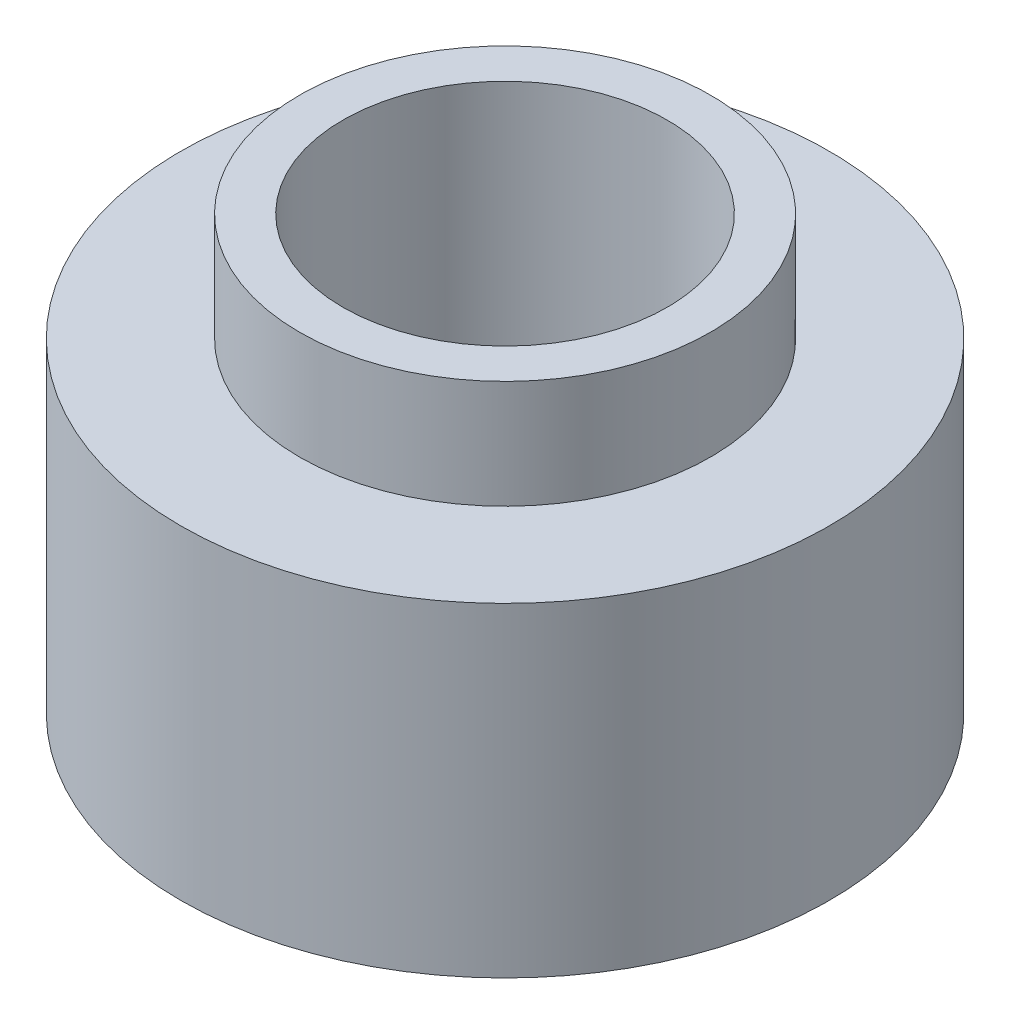
ISO-10303-21;
HEADER;
FILE_DESCRIPTION(('STEP AP214'),'2;1');
FILE_NAME('part.step','',(''),(''),'','','');
FILE_SCHEMA(('AUTOMOTIVE_DESIGN { 1 0 10303 214 1 1 1 1 }'));
ENDSEC;
DATA;
#1=APPLICATION_CONTEXT('core data for automotive mechanical design processes');
#2=APPLICATION_PROTOCOL_DEFINITION('international standard','automotive_design',2000,#1);
#3=PRODUCT_CONTEXT('',#1,'mechanical');
#4=PRODUCT('Part','Part','',(#3));
#5=PRODUCT_RELATED_PRODUCT_CATEGORY('part','',(#4));
#6=PRODUCT_DEFINITION_FORMATION('','',#4);
#7=PRODUCT_DEFINITION_CONTEXT('part definition',#1,'design');
#8=PRODUCT_DEFINITION('design','',#6,#7);
#9=PRODUCT_DEFINITION_SHAPE('','',#8);
#10=(LENGTH_UNIT() NAMED_UNIT(*) SI_UNIT(.MILLI.,.METRE.));
#11=(NAMED_UNIT(*) PLANE_ANGLE_UNIT() SI_UNIT($,.RADIAN.));
#12=(NAMED_UNIT(*) SI_UNIT($,.STERADIAN.) SOLID_ANGLE_UNIT());
#13=UNCERTAINTY_MEASURE_WITH_UNIT(LENGTH_MEASURE(1.E-05),#10,'distance_accuracy_value','');
#14=(GEOMETRIC_REPRESENTATION_CONTEXT(3) GLOBAL_UNCERTAINTY_ASSIGNED_CONTEXT((#13)) GLOBAL_UNIT_ASSIGNED_CONTEXT((#10,
#11,#12)) REPRESENTATION_CONTEXT('',''));
#15=CARTESIAN_POINT('',(0.,0.,0.));
#16=DIRECTION('',(0.,0.,1.));
#17=DIRECTION('',(1.,0.,0.));
#18=AXIS2_PLACEMENT_3D('',#15,#16,#17);
#19=CARTESIAN_POINT('',(9.525,0.,0.));
#20=DIRECTION('',(0.,1.,0.));
#21=DIRECTION('',(0.,0.,1.));
#22=AXIS2_PLACEMENT_3D('',#19,#20,#21);
#23=PLANE('',#22);
#24=CARTESIAN_POINT('',(0.,0.,0.));
#25=DIRECTION('',(0.,1.,0.));
#26=DIRECTION('',(0.,0.,1.));
#27=AXIS2_PLACEMENT_3D('',#24,#25,#26);
#28=CIRCLE('',#27,9.525);
#29=CARTESIAN_POINT('',(0.,0.,9.525));
#30=VERTEX_POINT('',#29);
#31=EDGE_CURVE('E68',#30,#30,#28,.T.);
#32=ORIENTED_EDGE('',*,*,#31,.F.);
#33=EDGE_LOOP('',(#32));
#34=FACE_BOUND('',#33,.T.);
#35=CARTESIAN_POINT('',(0.,0.,0.));
#36=DIRECTION('',(0.,1.,0.));
#37=DIRECTION('',(0.,0.,1.));
#38=AXIS2_PLACEMENT_3D('',#35,#36,#37);
#39=CIRCLE('',#38,4.7625);
#40=CARTESIAN_POINT('',(0.,0.,4.7625));
#41=VERTEX_POINT('',#40);
#42=EDGE_CURVE('E10',#41,#41,#39,.T.);
#43=ORIENTED_EDGE('',*,*,#42,.T.);
#44=EDGE_LOOP('',(#43));
#45=FACE_BOUND('',#44,.T.);
#46=ADVANCED_FACE('F41',(#34,#45),#23,.F.);
#47=CARTESIAN_POINT('',(0.,9.23847418427139,0.));
#48=DIRECTION('',(0.,1.,0.));
#49=DIRECTION('',(0.,0.,1.));
#50=AXIS2_PLACEMENT_3D('',#47,#48,#49);
#51=CYLINDRICAL_SURFACE('',#50,4.7625);
#52=ORIENTED_EDGE('',*,*,#42,.F.);
#53=EDGE_LOOP('',(#52));
#54=FACE_BOUND('',#53,.T.);
#55=CARTESIAN_POINT('',(0.,12.7,0.));
#56=DIRECTION('',(0.,1.,0.));
#57=DIRECTION('',(0.,0.,1.));
#58=AXIS2_PLACEMENT_3D('',#55,#56,#57);
#59=CIRCLE('',#58,4.7625);
#60=CARTESIAN_POINT('',(0.,12.7,4.7625));
#61=VERTEX_POINT('',#60);
#62=EDGE_CURVE('E48',#61,#61,#59,.T.);
#63=ORIENTED_EDGE('',*,*,#62,.T.);
#64=EDGE_LOOP('',(#63));
#65=FACE_BOUND('',#64,.T.);
#66=ADVANCED_FACE('F76',(#54,#65),#51,.F.);
#67=CARTESIAN_POINT('',(4.7625,12.7,0.));
#68=DIRECTION('',(0.,-1.,0.));
#69=DIRECTION('',(0.,0.,-1.));
#70=AXIS2_PLACEMENT_3D('',#67,#68,#69);
#71=PLANE('',#70);
#72=ORIENTED_EDGE('',*,*,#62,.F.);
#73=EDGE_LOOP('',(#72));
#74=FACE_BOUND('',#73,.T.);
#75=CARTESIAN_POINT('',(0.,12.7,0.));
#76=DIRECTION('',(0.,1.,0.));
#77=DIRECTION('',(0.,0.,1.));
#78=AXIS2_PLACEMENT_3D('',#75,#76,#77);
#79=CIRCLE('',#78,6.0325);
#80=CARTESIAN_POINT('',(0.,12.7,6.0325));
#81=VERTEX_POINT('',#80);
#82=EDGE_CURVE('E53',#81,#81,#79,.T.);
#83=ORIENTED_EDGE('',*,*,#82,.T.);
#84=EDGE_LOOP('',(#83));
#85=FACE_BOUND('',#84,.T.);
#86=ADVANCED_FACE('F80',(#74,#85),#71,.F.);
#87=CARTESIAN_POINT('',(0.,9.23847418427139,0.));
#88=DIRECTION('',(0.,1.,0.));
#89=DIRECTION('',(0.,0.,1.));
#90=AXIS2_PLACEMENT_3D('',#87,#88,#89);
#91=CYLINDRICAL_SURFACE('',#90,6.0325);
#92=ORIENTED_EDGE('',*,*,#82,.F.);
#93=EDGE_LOOP('',(#92));
#94=FACE_BOUND('',#93,.T.);
#95=CARTESIAN_POINT('',(0.,9.525,0.));
#96=DIRECTION('',(0.,1.,0.));
#97=DIRECTION('',(0.,0.,1.));
#98=AXIS2_PLACEMENT_3D('',#95,#96,#97);
#99=CIRCLE('',#98,6.0325);
#100=CARTESIAN_POINT('',(0.,9.525,6.0325));
#101=VERTEX_POINT('',#100);
#102=EDGE_CURVE('E58',#101,#101,#99,.T.);
#103=ORIENTED_EDGE('',*,*,#102,.T.);
#104=EDGE_LOOP('',(#103));
#105=FACE_BOUND('',#104,.T.);
#106=ADVANCED_FACE('F85',(#94,#105),#91,.T.);
#107=CARTESIAN_POINT('',(6.0325,9.525,0.));
#108=DIRECTION('',(0.,-1.,0.));
#109=DIRECTION('',(0.,0.,-1.));
#110=AXIS2_PLACEMENT_3D('',#107,#108,#109);
#111=PLANE('',#110);
#112=ORIENTED_EDGE('',*,*,#102,.F.);
#113=EDGE_LOOP('',(#112));
#114=FACE_BOUND('',#113,.T.);
#115=CARTESIAN_POINT('',(0.,9.525,0.));
#116=DIRECTION('',(0.,1.,0.));
#117=DIRECTION('',(0.,0.,1.));
#118=AXIS2_PLACEMENT_3D('',#115,#116,#117);
#119=CIRCLE('',#118,9.525);
#120=CARTESIAN_POINT('',(0.,9.525,9.525));
#121=VERTEX_POINT('',#120);
#122=EDGE_CURVE('E64',#121,#121,#119,.T.);
#123=ORIENTED_EDGE('',*,*,#122,.T.);
#124=EDGE_LOOP('',(#123));
#125=FACE_BOUND('',#124,.T.);
#126=ADVANCED_FACE('F91',(#114,#125),#111,.F.);
#127=CARTESIAN_POINT('',(0.,9.23847418427139,0.));
#128=DIRECTION('',(0.,1.,0.));
#129=DIRECTION('',(0.,0.,1.));
#130=AXIS2_PLACEMENT_3D('',#127,#128,#129);
#131=CYLINDRICAL_SURFACE('',#130,9.525);
#132=ORIENTED_EDGE('',*,*,#122,.F.);
#133=EDGE_LOOP('',(#132));
#134=FACE_BOUND('',#133,.T.);
#135=ORIENTED_EDGE('',*,*,#31,.T.);
#136=EDGE_LOOP('',(#135));
#137=FACE_BOUND('',#136,.T.);
#138=ADVANCED_FACE('F73',(#134,#137),#131,.T.);
#139=CLOSED_SHELL('',(#46,#66,#86,#106,#126,#138));
#140=MANIFOLD_SOLID_BREP('B2',#139);
#141=ADVANCED_BREP_SHAPE_REPRESENTATION('',(#18,#140),#14);
#142=SHAPE_DEFINITION_REPRESENTATION(#9,#141);
ENDSEC;
END-ISO-10303-21;
